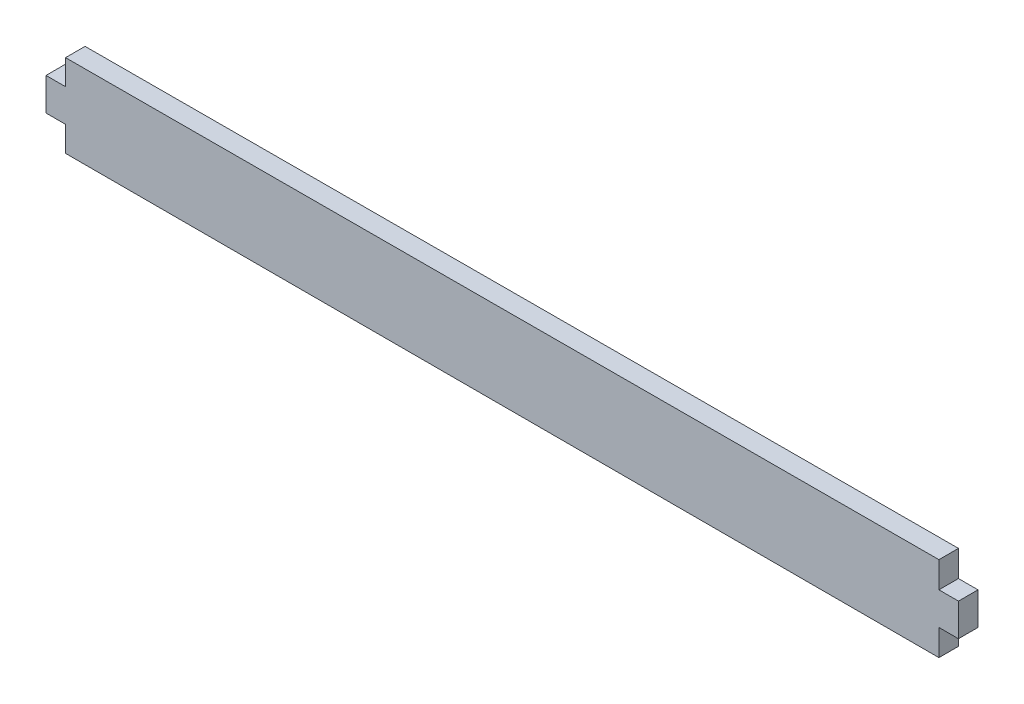
ISO-10303-21;
HEADER;
FILE_DESCRIPTION(('STEP AP214'),'2;1');
FILE_NAME('part.step','',(''),(''),'','','');
FILE_SCHEMA(('AUTOMOTIVE_DESIGN { 1 0 10303 214 1 1 1 1 }'));
ENDSEC;
DATA;
#1=APPLICATION_CONTEXT('core data for automotive mechanical design processes');
#2=APPLICATION_PROTOCOL_DEFINITION('international standard','automotive_design',2000,#1);
#3=PRODUCT_CONTEXT('',#1,'mechanical');
#4=PRODUCT('Part','Part','',(#3));
#5=PRODUCT_RELATED_PRODUCT_CATEGORY('part','',(#4));
#6=PRODUCT_DEFINITION_FORMATION('','',#4);
#7=PRODUCT_DEFINITION_CONTEXT('part definition',#1,'design');
#8=PRODUCT_DEFINITION('design','',#6,#7);
#9=PRODUCT_DEFINITION_SHAPE('','',#8);
#10=(LENGTH_UNIT() NAMED_UNIT(*) SI_UNIT(.MILLI.,.METRE.));
#11=(NAMED_UNIT(*) PLANE_ANGLE_UNIT() SI_UNIT($,.RADIAN.));
#12=(NAMED_UNIT(*) SI_UNIT($,.STERADIAN.) SOLID_ANGLE_UNIT());
#13=UNCERTAINTY_MEASURE_WITH_UNIT(LENGTH_MEASURE(1.E-05),#10,'distance_accuracy_value','');
#14=(GEOMETRIC_REPRESENTATION_CONTEXT(3) GLOBAL_UNCERTAINTY_ASSIGNED_CONTEXT((#13)) GLOBAL_UNIT_ASSIGNED_CONTEXT((#10,
#11,#12)) REPRESENTATION_CONTEXT('',''));
#15=CARTESIAN_POINT('',(0.,0.,0.));
#16=DIRECTION('',(0.,0.,1.));
#17=DIRECTION('',(1.,0.,0.));
#18=AXIS2_PLACEMENT_3D('',#15,#16,#17);
#19=CARTESIAN_POINT('',(-75.153373951576,22.8127555674385,5.9944));
#20=DIRECTION('',(0.,1.,0.));
#21=DIRECTION('',(-1.,0.,0.));
#22=AXIS2_PLACEMENT_3D('',#19,#20,#21);
#23=PLANE('',#22);
#24=DIRECTION('',(1.,0.,0.));
#25=VECTOR('',#24,1.);
#26=CARTESIAN_POINT('',(-75.153373951576,22.8127555674385,0.));
#27=LINE('',#26,#25);
#28=CARTESIAN_POINT('',(58.8274588055032,22.8127555674389,0.));
#29=VERTEX_POINT('',#28);
#30=CARTESIAN_POINT('',(64.8218588055033,22.8127555674389,0.));
#31=VERTEX_POINT('',#30);
#32=EDGE_CURVE('E152',#29,#31,#27,.T.);
#33=ORIENTED_EDGE('',*,*,#32,.F.);
#34=DIRECTION('',(0.,0.,-1.));
#35=VECTOR('',#34,1.);
#36=CARTESIAN_POINT('',(58.8274588055032,22.8127555674389,5.9944));
#37=LINE('',#36,#35);
#38=CARTESIAN_POINT('',(58.8274588055032,22.8127555674389,5.9944));
#39=VERTEX_POINT('',#38);
#40=EDGE_CURVE('E11',#39,#29,#37,.T.);
#41=ORIENTED_EDGE('',*,*,#40,.F.);
#42=DIRECTION('',(1.,0.,0.));
#43=VECTOR('',#42,1.);
#44=CARTESIAN_POINT('',(-75.153373951576,22.8127555674385,5.9944));
#45=LINE('',#44,#43);
#46=CARTESIAN_POINT('',(64.8218588055033,22.8127555674389,5.9944));
#47=VERTEX_POINT('',#46);
#48=EDGE_CURVE('E178',#39,#47,#45,.T.);
#49=ORIENTED_EDGE('',*,*,#48,.T.);
#50=DIRECTION('',(0.,0.,-1.));
#51=VECTOR('',#50,1.);
#52=CARTESIAN_POINT('',(64.8218588055033,22.8127555674389,5.9944));
#53=LINE('',#52,#51);
#54=EDGE_CURVE('E95',#47,#31,#53,.T.);
#55=ORIENTED_EDGE('',*,*,#54,.T.);
#56=EDGE_LOOP('',(#33,#41,#49,#55));
#57=FACE_BOUND('',#56,.T.);
#58=ADVANCED_FACE('F32',(#57),#23,.T.);
#59=CARTESIAN_POINT('',(58.8274588055009,-201.01886348818,5.9944));
#60=DIRECTION('',(-1.,0.,0.));
#61=DIRECTION('',(0.,-1.,0.));
#62=AXIS2_PLACEMENT_3D('',#59,#60,#61);
#63=PLANE('',#62);
#64=DIRECTION('',(0.,1.,0.));
#65=VECTOR('',#64,1.);
#66=CARTESIAN_POINT('',(58.8274588055009,-201.01886348818,0.));
#67=LINE('',#66,#65);
#68=CARTESIAN_POINT('',(58.8274588055033,30.8318669031275,0.));
#69=VERTEX_POINT('',#68);
#70=EDGE_CURVE('E155',#29,#69,#67,.T.);
#71=ORIENTED_EDGE('',*,*,#70,.T.);
#72=DIRECTION('',(0.,0.,-1.));
#73=VECTOR('',#72,1.);
#74=CARTESIAN_POINT('',(58.8274588055033,30.8318669031275,5.9944));
#75=LINE('',#74,#73);
#76=CARTESIAN_POINT('',(58.8274588055033,30.8318669031275,5.9944));
#77=VERTEX_POINT('',#76);
#78=EDGE_CURVE('E40',#77,#69,#75,.T.);
#79=ORIENTED_EDGE('',*,*,#78,.F.);
#80=DIRECTION('',(0.,1.,0.));
#81=VECTOR('',#80,1.);
#82=CARTESIAN_POINT('',(58.8274588055009,-201.01886348818,5.9944));
#83=LINE('',#82,#81);
#84=EDGE_CURVE('E138',#39,#77,#83,.T.);
#85=ORIENTED_EDGE('',*,*,#84,.F.);
#86=ORIENTED_EDGE('',*,*,#40,.T.);
#87=EDGE_LOOP('',(#71,#79,#85,#86));
#88=FACE_BOUND('',#87,.T.);
#89=ADVANCED_FACE('F246',(#88),#63,.F.);
#90=CARTESIAN_POINT('',(-75.6691444757559,30.5322813250435,5.9944));
#91=DIRECTION('',(0.00222745279486939,-0.999997519223946,0.));
#92=DIRECTION('',(0.999997519223946,0.00222745279486939,0.));
#93=AXIS2_PLACEMENT_3D('',#90,#91,#92);
#94=PLANE('',#93);
#95=DIRECTION('',(-0.999997519223946,-0.00222745279486939,0.));
#96=VECTOR('',#95,1.);
#97=CARTESIAN_POINT('',(-75.6691444757559,30.5322813250435,0.));
#98=LINE('',#97,#96);
#99=CARTESIAN_POINT('',(-209.134206708654,30.2349934616508,0.));
#100=VERTEX_POINT('',#99);
#101=EDGE_CURVE('E157',#69,#100,#98,.T.);
#102=ORIENTED_EDGE('',*,*,#101,.T.);
#103=DIRECTION('',(0.,0.,-1.));
#104=VECTOR('',#103,1.);
#105=CARTESIAN_POINT('',(-209.134206708654,30.2349934616508,5.9944));
#106=LINE('',#105,#104);
#107=CARTESIAN_POINT('',(-209.134206708654,30.2349934616508,5.9944));
#108=VERTEX_POINT('',#107);
#109=EDGE_CURVE('E192',#108,#100,#106,.T.);
#110=ORIENTED_EDGE('',*,*,#109,.F.);
#111=DIRECTION('',(-0.999997519223946,-0.00222745279486939,0.));
#112=VECTOR('',#111,1.);
#113=CARTESIAN_POINT('',(-75.6691444757559,30.5322813250435,5.9944));
#114=LINE('',#113,#112);
#115=EDGE_CURVE('E200',#77,#108,#114,.T.);
#116=ORIENTED_EDGE('',*,*,#115,.F.);
#117=ORIENTED_EDGE('',*,*,#78,.T.);
#118=EDGE_LOOP('',(#102,#110,#116,#117));
#119=FACE_BOUND('',#118,.T.);
#120=ADVANCED_FACE('F198',(#119),#94,.F.);
#121=CARTESIAN_POINT('',(-209.134206708654,-201.018863488179,5.9944));
#122=DIRECTION('',(-1.,0.,0.));
#123=DIRECTION('',(0.,0.,1.));
#124=AXIS2_PLACEMENT_3D('',#121,#122,#123);
#125=PLANE('',#124);
#126=DIRECTION('',(0.,1.,0.));
#127=VECTOR('',#126,1.);
#128=CARTESIAN_POINT('',(-209.134206708654,-201.018863488179,0.));
#129=LINE('',#128,#127);
#130=CARTESIAN_POINT('',(-209.134206708654,22.5143188467004,0.));
#131=VERTEX_POINT('',#130);
#132=EDGE_CURVE('E160',#131,#100,#129,.T.);
#133=ORIENTED_EDGE('',*,*,#132,.F.);
#134=DIRECTION('',(0.,0.,-1.));
#135=VECTOR('',#134,1.);
#136=CARTESIAN_POINT('',(-209.134206708654,22.5143188467004,5.9944));
#137=LINE('',#136,#135);
#138=CARTESIAN_POINT('',(-209.134206708654,22.5143188467004,5.9944));
#139=VERTEX_POINT('',#138);
#140=EDGE_CURVE('E190',#139,#131,#137,.T.);
#141=ORIENTED_EDGE('',*,*,#140,.F.);
#142=DIRECTION('',(0.,1.,0.));
#143=VECTOR('',#142,1.);
#144=CARTESIAN_POINT('',(-209.134206708654,-201.018863488179,5.9944));
#145=LINE('',#144,#143);
#146=EDGE_CURVE('E211',#139,#108,#145,.T.);
#147=ORIENTED_EDGE('',*,*,#146,.T.);
#148=ORIENTED_EDGE('',*,*,#109,.T.);
#149=EDGE_LOOP('',(#133,#141,#147,#148));
#150=FACE_BOUND('',#149,.T.);
#151=ADVANCED_FACE('F208',(#150),#125,.T.);
#152=CARTESIAN_POINT('',(-75.153373951576,22.5143188467008,5.9944));
#153=DIRECTION('',(0.,1.,0.));
#154=DIRECTION('',(-1.,0.,0.));
#155=AXIS2_PLACEMENT_3D('',#152,#153,#154);
#156=PLANE('',#155);
#157=DIRECTION('',(1.,0.,0.));
#158=VECTOR('',#157,1.);
#159=CARTESIAN_POINT('',(-75.153373951576,22.5143188467008,0.));
#160=LINE('',#159,#158);
#161=CARTESIAN_POINT('',(-215.128606708654,22.5143188467004,0.));
#162=VERTEX_POINT('',#161);
#163=EDGE_CURVE('E163',#162,#131,#160,.T.);
#164=ORIENTED_EDGE('',*,*,#163,.F.);
#165=DIRECTION('',(0.,0.,-1.));
#166=VECTOR('',#165,1.);
#167=CARTESIAN_POINT('',(-215.128606708654,22.5143188467004,5.9944));
#168=LINE('',#167,#166);
#169=CARTESIAN_POINT('',(-215.128606708654,22.5143188467004,5.9944));
#170=VERTEX_POINT('',#169);
#171=EDGE_CURVE('E188',#170,#162,#168,.T.);
#172=ORIENTED_EDGE('',*,*,#171,.F.);
#173=DIRECTION('',(1.,0.,0.));
#174=VECTOR('',#173,1.);
#175=CARTESIAN_POINT('',(-75.153373951576,22.5143188467008,5.9944));
#176=LINE('',#175,#174);
#177=EDGE_CURVE('E214',#170,#139,#176,.T.);
#178=ORIENTED_EDGE('',*,*,#177,.T.);
#179=ORIENTED_EDGE('',*,*,#140,.T.);
#180=EDGE_LOOP('',(#164,#172,#178,#179));
#181=FACE_BOUND('',#180,.T.);
#182=ADVANCED_FACE('F232',(#181),#156,.T.);
#183=CARTESIAN_POINT('',(-215.128606708653,-201.018863488179,5.9944));
#184=DIRECTION('',(-1.,0.,0.));
#185=DIRECTION('',(0.,-1.,0.));
#186=AXIS2_PLACEMENT_3D('',#183,#184,#185);
#187=PLANE('',#186);
#188=DIRECTION('',(0.,1.,0.));
#189=VECTOR('',#188,1.);
#190=CARTESIAN_POINT('',(-215.128606708653,-201.018863488179,0.));
#191=LINE('',#190,#189);
#192=CARTESIAN_POINT('',(-215.128606708654,12.5143188467004,0.));
#193=VERTEX_POINT('',#192);
#194=EDGE_CURVE('E167',#193,#162,#191,.T.);
#195=ORIENTED_EDGE('',*,*,#194,.F.);
#196=DIRECTION('',(0.,0.,-1.));
#197=VECTOR('',#196,1.);
#198=CARTESIAN_POINT('',(-215.128606708654,12.5143188467004,5.9944));
#199=LINE('',#198,#197);
#200=CARTESIAN_POINT('',(-215.128606708654,12.5143188467004,5.9944));
#201=VERTEX_POINT('',#200);
#202=EDGE_CURVE('E186',#201,#193,#199,.T.);
#203=ORIENTED_EDGE('',*,*,#202,.F.);
#204=DIRECTION('',(0.,1.,0.));
#205=VECTOR('',#204,1.);
#206=CARTESIAN_POINT('',(-215.128606708653,-201.018863488179,5.9944));
#207=LINE('',#206,#205);
#208=EDGE_CURVE('E217',#201,#170,#207,.T.);
#209=ORIENTED_EDGE('',*,*,#208,.T.);
#210=ORIENTED_EDGE('',*,*,#171,.T.);
#211=EDGE_LOOP('',(#195,#203,#209,#210));
#212=FACE_BOUND('',#211,.T.);
#213=ADVANCED_FACE('F230',(#212),#187,.T.);
#214=CARTESIAN_POINT('',(-75.1533739515761,12.5143188467009,5.9944));
#215=DIRECTION('',(0.,1.,0.));
#216=DIRECTION('',(-1.,0.,0.));
#217=AXIS2_PLACEMENT_3D('',#214,#215,#216);
#218=PLANE('',#217);
#219=DIRECTION('',(1.,0.,0.));
#220=VECTOR('',#219,1.);
#221=CARTESIAN_POINT('',(-75.1533739515761,12.5143188467009,0.));
#222=LINE('',#221,#220);
#223=CARTESIAN_POINT('',(-209.134206708654,12.5143188467004,0.));
#224=VERTEX_POINT('',#223);
#225=EDGE_CURVE('E170',#193,#224,#222,.T.);
#226=ORIENTED_EDGE('',*,*,#225,.T.);
#227=DIRECTION('',(0.,0.,-1.));
#228=VECTOR('',#227,1.);
#229=CARTESIAN_POINT('',(-209.134206708654,12.5143188467004,5.9944));
#230=LINE('',#229,#228);
#231=CARTESIAN_POINT('',(-209.134206708654,12.5143188467004,5.9944));
#232=VERTEX_POINT('',#231);
#233=EDGE_CURVE('E184',#232,#224,#230,.T.);
#234=ORIENTED_EDGE('',*,*,#233,.F.);
#235=DIRECTION('',(1.,0.,0.));
#236=VECTOR('',#235,1.);
#237=CARTESIAN_POINT('',(-75.1533739515761,12.5143188467009,5.9944));
#238=LINE('',#237,#236);
#239=EDGE_CURVE('E221',#201,#232,#238,.T.);
#240=ORIENTED_EDGE('',*,*,#239,.F.);
#241=ORIENTED_EDGE('',*,*,#202,.T.);
#242=EDGE_LOOP('',(#226,#234,#240,#241));
#243=FACE_BOUND('',#242,.T.);
#244=ADVANCED_FACE('F238',(#243),#218,.F.);
#245=CARTESIAN_POINT('',(-209.134206708654,4.79364423174999,0.));
#246=VERTEX_POINT('',#245);
#247=EDGE_CURVE('E164',#246,#224,#129,.T.);
#248=ORIENTED_EDGE('',*,*,#247,.F.);
#249=DIRECTION('',(0.,0.,-1.));
#250=VECTOR('',#249,1.);
#251=CARTESIAN_POINT('',(-209.134206708654,4.79364423174999,5.9944));
#252=LINE('',#251,#250);
#253=CARTESIAN_POINT('',(-209.134206708654,4.79364423174999,5.9944));
#254=VERTEX_POINT('',#253);
#255=EDGE_CURVE('E182',#254,#246,#252,.T.);
#256=ORIENTED_EDGE('',*,*,#255,.F.);
#257=EDGE_CURVE('E216',#254,#232,#145,.T.);
#258=ORIENTED_EDGE('',*,*,#257,.T.);
#259=ORIENTED_EDGE('',*,*,#233,.T.);
#260=EDGE_LOOP('',(#248,#256,#258,#259));
#261=FACE_BOUND('',#260,.T.);
#262=ADVANCED_FACE('F239',(#261),#125,.T.);
#263=CARTESIAN_POINT('',(-75.1533739515753,4.79364423174999,5.9944));
#264=DIRECTION('',(0.,1.,0.));
#265=DIRECTION('',(0.,0.,1.));
#266=AXIS2_PLACEMENT_3D('',#263,#264,#265);
#267=PLANE('',#266);
#268=DIRECTION('',(1.,0.,0.));
#269=VECTOR('',#268,1.);
#270=CARTESIAN_POINT('',(-75.1533739515753,4.79364423174999,0.));
#271=LINE('',#270,#269);
#272=CARTESIAN_POINT('',(58.827458805503,4.79364423174999,0.));
#273=VERTEX_POINT('',#272);
#274=EDGE_CURVE('E173',#246,#273,#271,.T.);
#275=ORIENTED_EDGE('',*,*,#274,.T.);
#276=DIRECTION('',(0.,0.,-1.));
#277=VECTOR('',#276,1.);
#278=CARTESIAN_POINT('',(58.827458805503,4.79364423174999,5.9944));
#279=LINE('',#278,#277);
#280=CARTESIAN_POINT('',(58.827458805503,4.79364423174999,5.9944));
#281=VERTEX_POINT('',#280);
#282=EDGE_CURVE('E143',#281,#273,#279,.T.);
#283=ORIENTED_EDGE('',*,*,#282,.F.);
#284=DIRECTION('',(1.,0.,0.));
#285=VECTOR('',#284,1.);
#286=CARTESIAN_POINT('',(-75.1533739515753,4.79364423174999,5.9944));
#287=LINE('',#286,#285);
#288=EDGE_CURVE('E133',#254,#281,#287,.T.);
#289=ORIENTED_EDGE('',*,*,#288,.F.);
#290=ORIENTED_EDGE('',*,*,#255,.T.);
#291=EDGE_LOOP('',(#275,#283,#289,#290));
#292=FACE_BOUND('',#291,.T.);
#293=ADVANCED_FACE('F241',(#292),#267,.F.);
#294=CARTESIAN_POINT('',(58.8274588055031,12.8127555674389,0.));
#295=VERTEX_POINT('',#294);
#296=EDGE_CURVE('E142',#273,#295,#67,.T.);
#297=ORIENTED_EDGE('',*,*,#296,.T.);
#298=DIRECTION('',(0.,0.,-1.));
#299=VECTOR('',#298,1.);
#300=CARTESIAN_POINT('',(58.8274588055031,12.8127555674389,5.9944));
#301=LINE('',#300,#299);
#302=CARTESIAN_POINT('',(58.8274588055031,12.8127555674389,5.9944));
#303=VERTEX_POINT('',#302);
#304=EDGE_CURVE('E139',#303,#295,#301,.T.);
#305=ORIENTED_EDGE('',*,*,#304,.F.);
#306=EDGE_CURVE('E126',#281,#303,#83,.T.);
#307=ORIENTED_EDGE('',*,*,#306,.F.);
#308=ORIENTED_EDGE('',*,*,#282,.T.);
#309=EDGE_LOOP('',(#297,#305,#307,#308));
#310=FACE_BOUND('',#309,.T.);
#311=ADVANCED_FACE('F140',(#310),#63,.F.);
#312=CARTESIAN_POINT('',(-75.1533739515761,12.8127555674384,5.9944));
#313=DIRECTION('',(0.,1.,0.));
#314=DIRECTION('',(-1.,0.,0.));
#315=AXIS2_PLACEMENT_3D('',#312,#313,#314);
#316=PLANE('',#315);
#317=DIRECTION('',(1.,0.,0.));
#318=VECTOR('',#317,1.);
#319=CARTESIAN_POINT('',(-75.1533739515761,12.8127555674384,0.));
#320=LINE('',#319,#318);
#321=CARTESIAN_POINT('',(64.8218588055033,12.8127555674389,0.));
#322=VERTEX_POINT('',#321);
#323=EDGE_CURVE('E88',#295,#322,#320,.T.);
#324=ORIENTED_EDGE('',*,*,#323,.T.);
#325=DIRECTION('',(0.,0.,-1.));
#326=VECTOR('',#325,1.);
#327=CARTESIAN_POINT('',(64.8218588055033,12.8127555674389,5.9944));
#328=LINE('',#327,#326);
#329=CARTESIAN_POINT('',(64.8218588055033,12.8127555674389,5.9944));
#330=VERTEX_POINT('',#329);
#331=EDGE_CURVE('E144',#330,#322,#328,.T.);
#332=ORIENTED_EDGE('',*,*,#331,.F.);
#333=DIRECTION('',(1.,0.,0.));
#334=VECTOR('',#333,1.);
#335=CARTESIAN_POINT('',(-75.1533739515761,12.8127555674384,5.9944));
#336=LINE('',#335,#334);
#337=EDGE_CURVE('E130',#303,#330,#336,.T.);
#338=ORIENTED_EDGE('',*,*,#337,.F.);
#339=ORIENTED_EDGE('',*,*,#304,.T.);
#340=EDGE_LOOP('',(#324,#332,#338,#339));
#341=FACE_BOUND('',#340,.T.);
#342=ADVANCED_FACE('F146',(#341),#316,.F.);
#343=CARTESIAN_POINT('',(64.8218588055042,-201.018863488178,5.9944));
#344=DIRECTION('',(-1.,0.,0.));
#345=DIRECTION('',(0.,-1.,0.));
#346=AXIS2_PLACEMENT_3D('',#343,#344,#345);
#347=PLANE('',#346);
#348=DIRECTION('',(0.,1.,0.));
#349=VECTOR('',#348,1.);
#350=CARTESIAN_POINT('',(64.8218588055042,-201.018863488178,0.));
#351=LINE('',#350,#349);
#352=EDGE_CURVE('E176',#322,#31,#351,.T.);
#353=ORIENTED_EDGE('',*,*,#352,.T.);
#354=ORIENTED_EDGE('',*,*,#54,.F.);
#355=DIRECTION('',(0.,1.,0.));
#356=VECTOR('',#355,1.);
#357=CARTESIAN_POINT('',(64.8218588055042,-201.018863488178,5.9944));
#358=LINE('',#357,#356);
#359=EDGE_CURVE('E48',#330,#47,#358,.T.);
#360=ORIENTED_EDGE('',*,*,#359,.F.);
#361=ORIENTED_EDGE('',*,*,#331,.T.);
#362=EDGE_LOOP('',(#353,#354,#360,#361));
#363=FACE_BOUND('',#362,.T.);
#364=ADVANCED_FACE('F244',(#363),#347,.F.);
#365=CARTESIAN_POINT('',(-75.1533739515753,-201.018863488179,5.9944));
#366=DIRECTION('',(0.,0.,1.));
#367=DIRECTION('',(1.,0.,0.));
#368=AXIS2_PLACEMENT_3D('',#365,#366,#367);
#369=PLANE('',#368);
#370=ORIENTED_EDGE('',*,*,#48,.F.);
#371=ORIENTED_EDGE('',*,*,#84,.T.);
#372=ORIENTED_EDGE('',*,*,#115,.T.);
#373=ORIENTED_EDGE('',*,*,#146,.F.);
#374=ORIENTED_EDGE('',*,*,#177,.F.);
#375=ORIENTED_EDGE('',*,*,#208,.F.);
#376=ORIENTED_EDGE('',*,*,#239,.T.);
#377=ORIENTED_EDGE('',*,*,#257,.F.);
#378=ORIENTED_EDGE('',*,*,#288,.T.);
#379=ORIENTED_EDGE('',*,*,#306,.T.);
#380=ORIENTED_EDGE('',*,*,#337,.T.);
#381=ORIENTED_EDGE('',*,*,#359,.T.);
#382=EDGE_LOOP('',(#370,#371,#372,#373,#374,#375,#376,#377,#378,#379,#380,#381));
#383=FACE_BOUND('',#382,.T.);
#384=ADVANCED_FACE('F128',(#383),#369,.T.);
#385=CARTESIAN_POINT('',(-75.1533739515753,-201.018863488179,0.));
#386=DIRECTION('',(0.,0.,1.));
#387=DIRECTION('',(1.,0.,0.));
#388=AXIS2_PLACEMENT_3D('',#385,#386,#387);
#389=PLANE('',#388);
#390=ORIENTED_EDGE('',*,*,#32,.T.);
#391=ORIENTED_EDGE('',*,*,#352,.F.);
#392=ORIENTED_EDGE('',*,*,#323,.F.);
#393=ORIENTED_EDGE('',*,*,#296,.F.);
#394=ORIENTED_EDGE('',*,*,#274,.F.);
#395=ORIENTED_EDGE('',*,*,#247,.T.);
#396=ORIENTED_EDGE('',*,*,#225,.F.);
#397=ORIENTED_EDGE('',*,*,#194,.T.);
#398=ORIENTED_EDGE('',*,*,#163,.T.);
#399=ORIENTED_EDGE('',*,*,#132,.T.);
#400=ORIENTED_EDGE('',*,*,#101,.F.);
#401=ORIENTED_EDGE('',*,*,#70,.F.);
#402=EDGE_LOOP('',(#390,#391,#392,#393,#394,#395,#396,#397,#398,#399,#400,#401));
#403=FACE_BOUND('',#402,.T.);
#404=ADVANCED_FACE('F204',(#403),#389,.F.);
#405=CLOSED_SHELL('',(#58,#89,#120,#151,#182,#213,#244,#262,#293,#311,#342,#364,#384,#404));
#406=MANIFOLD_SOLID_BREP('B2',#405);
#407=ADVANCED_BREP_SHAPE_REPRESENTATION('',(#18,#406),#14);
#408=SHAPE_DEFINITION_REPRESENTATION(#9,#407);
ENDSEC;
END-ISO-10303-21;
